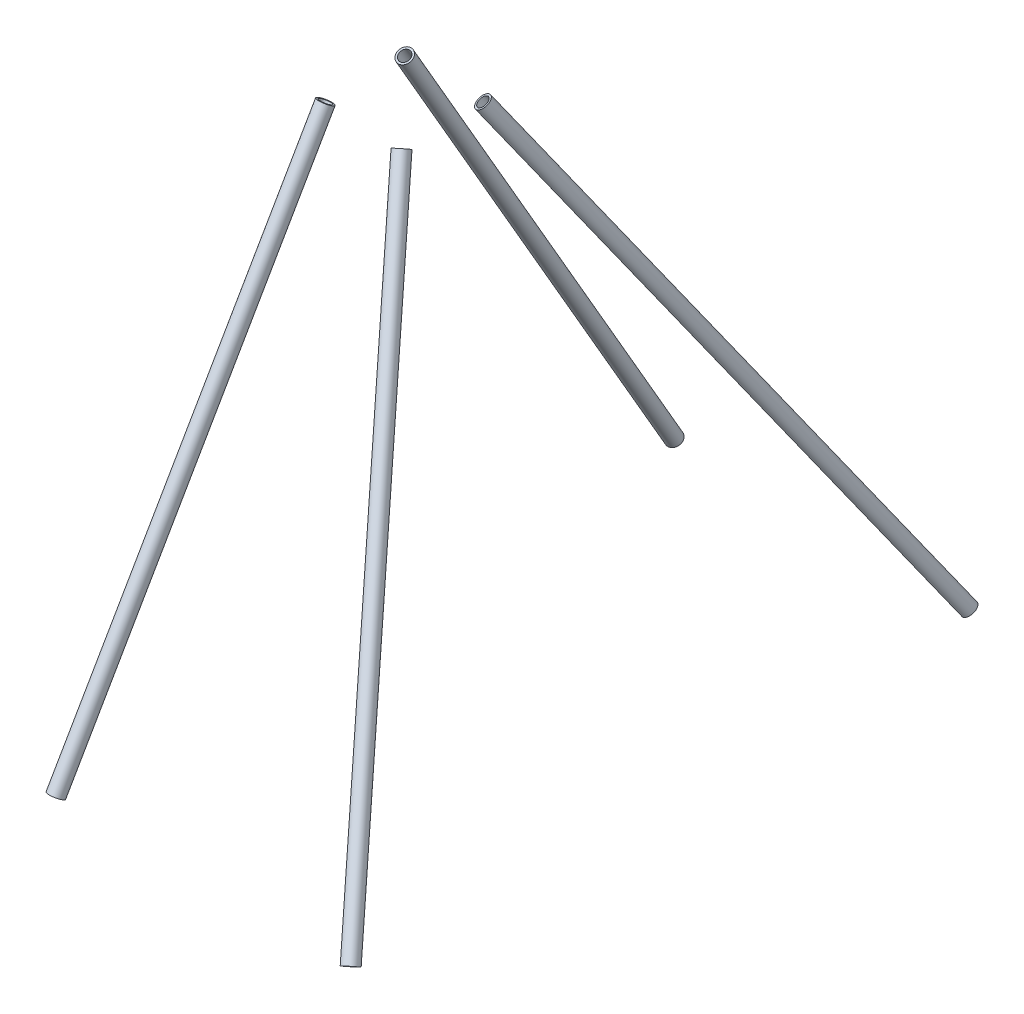
ISO-10303-21;
HEADER;
FILE_DESCRIPTION(('STEP AP214'),'2;1');
FILE_NAME('part.step','',(''),(''),'','','');
FILE_SCHEMA(('AUTOMOTIVE_DESIGN { 1 0 10303 214 1 1 1 1 }'));
ENDSEC;
DATA;
#1=APPLICATION_CONTEXT('core data for automotive mechanical design processes');
#2=APPLICATION_PROTOCOL_DEFINITION('international standard','automotive_design',2000,#1);
#3=PRODUCT_CONTEXT('',#1,'mechanical');
#4=PRODUCT('Part','Part','',(#3));
#5=PRODUCT_RELATED_PRODUCT_CATEGORY('part','',(#4));
#6=PRODUCT_DEFINITION_FORMATION('','',#4);
#7=PRODUCT_DEFINITION_CONTEXT('part definition',#1,'design');
#8=PRODUCT_DEFINITION('design','',#6,#7);
#9=PRODUCT_DEFINITION_SHAPE('','',#8);
#10=(LENGTH_UNIT() NAMED_UNIT(*) SI_UNIT(.MILLI.,.METRE.));
#11=(NAMED_UNIT(*) PLANE_ANGLE_UNIT() SI_UNIT($,.RADIAN.));
#12=(NAMED_UNIT(*) SI_UNIT($,.STERADIAN.) SOLID_ANGLE_UNIT());
#13=UNCERTAINTY_MEASURE_WITH_UNIT(LENGTH_MEASURE(1.E-05),#10,'distance_accuracy_value','');
#14=(GEOMETRIC_REPRESENTATION_CONTEXT(3) GLOBAL_UNCERTAINTY_ASSIGNED_CONTEXT((#13)) GLOBAL_UNIT_ASSIGNED_CONTEXT((#10,
#11,#12)) REPRESENTATION_CONTEXT('',''));
#15=CARTESIAN_POINT('',(0.,0.,0.));
#16=DIRECTION('',(0.,0.,1.));
#17=DIRECTION('',(1.,0.,0.));
#18=AXIS2_PLACEMENT_3D('',#15,#16,#17);
#19=CARTESIAN_POINT('',(65.9616903552644,-5.25160609123071,-34.7860847714928));
#20=DIRECTION('',(-0.376029615587523,0.802196513253382,0.463769859224612));
#21=DIRECTION('',(0.,0.500502949237855,-0.865734831114128));
#22=AXIS2_PLACEMENT_3D('',#19,#20,#21);
#23=PLANE('',#22);
#24=CARTESIAN_POINT('',(65.9616903552644,-5.25160609123071,-34.7860847714928));
#25=DIRECTION('',(0.376029615587523,-0.802196513253382,-0.463769859224612));
#26=DIRECTION('',(0.,0.500502949237855,-0.865734831114128));
#27=AXIS2_PLACEMENT_3D('',#24,#25,#26);
#28=CIRCLE('',#27,6.35000000000002);
#29=CARTESIAN_POINT('',(65.9616903552644,-2.07341236357032,-40.2835009490675));
#30=VERTEX_POINT('',#29);
#31=EDGE_CURVE('E11',#30,#30,#28,.T.);
#32=ORIENTED_EDGE('',*,*,#31,.F.);
#33=EDGE_LOOP('',(#32));
#34=FACE_BOUND('',#33,.T.);
#35=CARTESIAN_POINT('',(65.9616903552644,-5.25160609123071,-34.7860847714928));
#36=DIRECTION('',(0.376029615587523,-0.802196513253382,-0.463769859224612));
#37=DIRECTION('',(0.,0.500502949237855,-0.865734831114128));
#38=AXIS2_PLACEMENT_3D('',#35,#36,#37);
#39=CIRCLE('',#38,4.69900000000002);
#40=CARTESIAN_POINT('',(65.9616903552644,-2.89974273276202,-38.8541727428981));
#41=VERTEX_POINT('',#40);
#42=EDGE_CURVE('E55',#41,#41,#39,.T.);
#43=ORIENTED_EDGE('',*,*,#42,.T.);
#44=EDGE_LOOP('',(#43));
#45=FACE_BOUND('',#44,.T.);
#46=ADVANCED_FACE('F44',(#34,#45),#23,.T.);
#47=CARTESIAN_POINT('',(252.209158955764,-402.579539105631,-264.491296045443));
#48=DIRECTION('',(-0.376029615587523,0.802196513253382,0.463769859224612));
#49=DIRECTION('',(0.,0.500502949237855,-0.865734831114128));
#50=AXIS2_PLACEMENT_3D('',#47,#48,#49);
#51=PLANE('',#50);
#52=CARTESIAN_POINT('',(252.209158955764,-402.579539105631,-264.491296045443));
#53=DIRECTION('',(0.376029615587523,-0.802196513253382,-0.463769859224612));
#54=DIRECTION('',(0.,0.500502949237855,-0.865734831114128));
#55=AXIS2_PLACEMENT_3D('',#52,#53,#54);
#56=CIRCLE('',#55,6.35000000000002);
#57=CARTESIAN_POINT('',(252.209158955764,-399.401345377971,-269.988712223018));
#58=VERTEX_POINT('',#57);
#59=EDGE_CURVE('E48',#58,#58,#56,.T.);
#60=ORIENTED_EDGE('',*,*,#59,.T.);
#61=EDGE_LOOP('',(#60));
#62=FACE_BOUND('',#61,.T.);
#63=CARTESIAN_POINT('',(252.209158955764,-402.579539105631,-264.491296045443));
#64=DIRECTION('',(0.376029615587523,-0.802196513253382,-0.463769859224612));
#65=DIRECTION('',(0.,0.500502949237855,-0.865734831114128));
#66=AXIS2_PLACEMENT_3D('',#63,#64,#65);
#67=CIRCLE('',#66,4.69900000000002);
#68=CARTESIAN_POINT('',(252.209158955764,-400.227675747162,-268.559384016848));
#69=VERTEX_POINT('',#68);
#70=EDGE_CURVE('E57',#69,#69,#67,.T.);
#71=ORIENTED_EDGE('',*,*,#70,.F.);
#72=EDGE_LOOP('',(#71));
#73=FACE_BOUND('',#72,.T.);
#74=ADVANCED_FACE('F70',(#62,#73),#51,.F.);
#75=CARTESIAN_POINT('',(65.9616903552644,-5.25160609123071,-34.7860847714928));
#76=DIRECTION('',(0.376029615587523,-0.802196513253382,-0.463769859224612));
#77=DIRECTION('',(0.,-0.500502949237855,0.865734831114128));
#78=AXIS2_PLACEMENT_3D('',#75,#76,#77);
#79=CYLINDRICAL_SURFACE('',#78,6.35000000000002);
#80=ORIENTED_EDGE('',*,*,#31,.T.);
#81=EDGE_LOOP('',(#80));
#82=FACE_BOUND('',#81,.T.);
#83=ORIENTED_EDGE('',*,*,#59,.F.);
#84=EDGE_LOOP('',(#83));
#85=FACE_BOUND('',#84,.T.);
#86=ADVANCED_FACE('F46',(#82,#85),#79,.T.);
#87=CARTESIAN_POINT('',(65.9616903552644,-5.25160609123071,-34.7860847714928));
#88=DIRECTION('',(0.376029615587523,-0.802196513253382,-0.463769859224612));
#89=DIRECTION('',(0.,-0.500502949237855,0.865734831114128));
#90=AXIS2_PLACEMENT_3D('',#87,#88,#89);
#91=CYLINDRICAL_SURFACE('',#90,4.69900000000002);
#92=ORIENTED_EDGE('',*,*,#42,.F.);
#93=EDGE_LOOP('',(#92));
#94=FACE_BOUND('',#93,.T.);
#95=ORIENTED_EDGE('',*,*,#70,.T.);
#96=EDGE_LOOP('',(#95));
#97=FACE_BOUND('',#96,.T.);
#98=ADVANCED_FACE('F64',(#94,#97),#91,.F.);
#99=CLOSED_SHELL('',(#46,#74,#86,#98));
#100=MANIFOLD_SOLID_BREP('B2',#99);
#101=CARTESIAN_POINT('',(0.,-3.71426499265221,-33.8973094488771));
#102=DIRECTION('',(0.,-0.865734831114129,-0.500502949237855));
#103=DIRECTION('',(0.,-0.500502949237855,0.865734831114129));
#104=AXIS2_PLACEMENT_3D('',#101,#102,#103);
#105=CYLINDRICAL_SURFACE('',#104,4.699);
#106=CARTESIAN_POINT('',(0.,-3.71426499265221,-33.8973094488771));
#107=DIRECTION('',(0.,0.865734831114128,0.500502949237857));
#108=DIRECTION('',(0.,-0.500502949237857,0.865734831114128));
#109=AXIS2_PLACEMENT_3D('',#106,#107,#108);
#110=CIRCLE('',#109,4.699);
#111=CARTESIAN_POINT('',(0.,-6.06612835112089,-29.8292214774718));
#112=VERTEX_POINT('',#111);
#113=EDGE_CURVE('E139',#112,#112,#110,.T.);
#114=ORIENTED_EDGE('',*,*,#113,.T.);
#115=EDGE_LOOP('',(#114));
#116=FACE_BOUND('',#115,.T.);
#117=CARTESIAN_POINT('',(0.,-402.276937866819,-264.316354704255));
#118=DIRECTION('',(0.,0.865734831114128,0.500502949237857));
#119=DIRECTION('',(0.,-0.500502949237857,0.865734831114128));
#120=AXIS2_PLACEMENT_3D('',#117,#118,#119);
#121=CIRCLE('',#120,4.699);
#122=CARTESIAN_POINT('',(0.,-404.628801225288,-260.248266732849));
#123=VERTEX_POINT('',#122);
#124=EDGE_CURVE('E145',#123,#123,#121,.T.);
#125=ORIENTED_EDGE('',*,*,#124,.F.);
#126=EDGE_LOOP('',(#125));
#127=FACE_BOUND('',#126,.T.);
#128=ADVANCED_FACE('F132',(#116,#127),#105,.F.);
#129=CARTESIAN_POINT('',(0.,-3.71426499265221,-33.8973094488771));
#130=DIRECTION('',(0.,-0.865734831114129,-0.500502949237855));
#131=DIRECTION('',(0.,-0.500502949237855,0.865734831114129));
#132=AXIS2_PLACEMENT_3D('',#129,#130,#131);
#133=CYLINDRICAL_SURFACE('',#132,6.35);
#134=CARTESIAN_POINT('',(0.,-3.71426499265221,-33.8973094488771));
#135=DIRECTION('',(0.,0.865734831114128,0.500502949237857));
#136=DIRECTION('',(0.,-0.500502949237857,0.865734831114128));
#137=AXIS2_PLACEMENT_3D('',#134,#135,#136);
#138=CIRCLE('',#137,6.35);
#139=CARTESIAN_POINT('',(0.,-6.8924587203126,-28.3998932713024));
#140=VERTEX_POINT('',#139);
#141=EDGE_CURVE('E43',#140,#140,#138,.T.);
#142=ORIENTED_EDGE('',*,*,#141,.F.);
#143=EDGE_LOOP('',(#142));
#144=FACE_BOUND('',#143,.T.);
#145=CARTESIAN_POINT('',(0.,-402.276937866819,-264.316354704255));
#146=DIRECTION('',(0.,0.865734831114128,0.500502949237857));
#147=DIRECTION('',(0.,-0.500502949237857,0.865734831114128));
#148=AXIS2_PLACEMENT_3D('',#145,#146,#147);
#149=CIRCLE('',#148,6.35);
#150=CARTESIAN_POINT('',(0.,-405.45513159448,-258.81893852668));
#151=VERTEX_POINT('',#150);
#152=EDGE_CURVE('E135',#151,#151,#149,.T.);
#153=ORIENTED_EDGE('',*,*,#152,.T.);
#154=EDGE_LOOP('',(#153));
#155=FACE_BOUND('',#154,.T.);
#156=ADVANCED_FACE('F152',(#144,#155),#133,.T.);
#157=CARTESIAN_POINT('',(0.,-17.471630042972,-10.1007861185942));
#158=DIRECTION('',(0.,-0.865734831114128,-0.500502949237857));
#159=DIRECTION('',(0.,-0.500502949237857,0.865734831114128));
#160=AXIS2_PLACEMENT_3D('',#157,#158,#159);
#161=PLANE('',#160);
#162=ORIENTED_EDGE('',*,*,#113,.F.);
#163=EDGE_LOOP('',(#162));
#164=FACE_BOUND('',#163,.T.);
#165=ORIENTED_EDGE('',*,*,#141,.T.);
#166=EDGE_LOOP('',(#165));
#167=FACE_BOUND('',#166,.T.);
#168=ADVANCED_FACE('F156',(#164,#167),#161,.F.);
#169=CARTESIAN_POINT('',(0.,-416.034302917139,-240.519831373972));
#170=DIRECTION('',(0.,-0.865734831114128,-0.500502949237857));
#171=DIRECTION('',(0.,-0.500502949237857,0.865734831114128));
#172=AXIS2_PLACEMENT_3D('',#169,#170,#171);
#173=PLANE('',#172);
#174=ORIENTED_EDGE('',*,*,#124,.T.);
#175=EDGE_LOOP('',(#174));
#176=FACE_BOUND('',#175,.T.);
#177=ORIENTED_EDGE('',*,*,#152,.F.);
#178=EDGE_LOOP('',(#177));
#179=FACE_BOUND('',#178,.T.);
#180=ADVANCED_FACE('F154',(#176,#179),#173,.T.);
#181=CLOSED_SHELL('',(#128,#156,#168,#180));
#182=MANIFOLD_SOLID_BREP('B6',#181);
#183=CARTESIAN_POINT('',(65.9616903552644,-5.25160609123071,34.7860847714928));
#184=DIRECTION('',(-0.376029615587523,0.802196513253382,-0.463769859224612));
#185=DIRECTION('',(0.,0.500502949237855,0.865734831114128));
#186=AXIS2_PLACEMENT_3D('',#183,#184,#185);
#187=PLANE('',#186);
#188=CARTESIAN_POINT('',(65.9616903552644,-5.25160609123071,34.7860847714928));
#189=DIRECTION('',(-0.376029615587523,0.802196513253382,-0.463769859224612));
#190=DIRECTION('',(0.,0.500502949237855,0.865734831114128));
#191=AXIS2_PLACEMENT_3D('',#188,#189,#190);
#192=CIRCLE('',#191,6.35000000000002);
#193=CARTESIAN_POINT('',(65.9616903552644,-2.07341236357032,40.2835009490675));
#194=VERTEX_POINT('',#193);
#195=EDGE_CURVE('E131',#194,#194,#192,.T.);
#196=ORIENTED_EDGE('',*,*,#195,.T.);
#197=EDGE_LOOP('',(#196));
#198=FACE_BOUND('',#197,.T.);
#199=CARTESIAN_POINT('',(65.9616903552644,-5.25160609123071,34.7860847714928));
#200=DIRECTION('',(-0.376029615587523,0.802196513253382,-0.463769859224612));
#201=DIRECTION('',(0.,0.500502949237855,0.865734831114128));
#202=AXIS2_PLACEMENT_3D('',#199,#200,#201);
#203=CIRCLE('',#202,4.69900000000002);
#204=CARTESIAN_POINT('',(65.9616903552644,-2.89974273276202,38.8541727428981));
#205=VERTEX_POINT('',#204);
#206=EDGE_CURVE('E232',#205,#205,#203,.T.);
#207=ORIENTED_EDGE('',*,*,#206,.F.);
#208=EDGE_LOOP('',(#207));
#209=FACE_BOUND('',#208,.T.);
#210=ADVANCED_FACE('F221',(#198,#209),#187,.T.);
#211=CARTESIAN_POINT('',(252.209158955764,-402.579539105631,264.491296045443));
#212=DIRECTION('',(-0.376029615587523,0.802196513253382,-0.463769859224612));
#213=DIRECTION('',(0.,0.500502949237855,0.865734831114128));
#214=AXIS2_PLACEMENT_3D('',#211,#212,#213);
#215=PLANE('',#214);
#216=CARTESIAN_POINT('',(252.209158955764,-402.579539105631,264.491296045443));
#217=DIRECTION('',(-0.376029615587523,0.802196513253382,-0.463769859224612));
#218=DIRECTION('',(0.,0.500502949237855,0.865734831114128));
#219=AXIS2_PLACEMENT_3D('',#216,#217,#218);
#220=CIRCLE('',#219,6.35000000000002);
#221=CARTESIAN_POINT('',(252.209158955764,-399.401345377971,269.988712223018));
#222=VERTEX_POINT('',#221);
#223=EDGE_CURVE('E225',#222,#222,#220,.T.);
#224=ORIENTED_EDGE('',*,*,#223,.F.);
#225=EDGE_LOOP('',(#224));
#226=FACE_BOUND('',#225,.T.);
#227=CARTESIAN_POINT('',(252.209158955764,-402.579539105631,264.491296045443));
#228=DIRECTION('',(-0.376029615587523,0.802196513253382,-0.463769859224612));
#229=DIRECTION('',(0.,0.500502949237855,0.865734831114128));
#230=AXIS2_PLACEMENT_3D('',#227,#228,#229);
#231=CIRCLE('',#230,4.69900000000002);
#232=CARTESIAN_POINT('',(252.209158955764,-400.227675747162,268.559384016848));
#233=VERTEX_POINT('',#232);
#234=EDGE_CURVE('E234',#233,#233,#231,.T.);
#235=ORIENTED_EDGE('',*,*,#234,.T.);
#236=EDGE_LOOP('',(#235));
#237=FACE_BOUND('',#236,.T.);
#238=ADVANCED_FACE('F244',(#226,#237),#215,.F.);
#239=CARTESIAN_POINT('',(65.9616903552644,-5.25160609123071,34.7860847714928));
#240=DIRECTION('',(0.376029615587523,-0.802196513253382,0.463769859224612));
#241=DIRECTION('',(0.,-0.500502949237855,-0.865734831114128));
#242=AXIS2_PLACEMENT_3D('',#239,#240,#241);
#243=CYLINDRICAL_SURFACE('',#242,6.35000000000002);
#244=ORIENTED_EDGE('',*,*,#195,.F.);
#245=EDGE_LOOP('',(#244));
#246=FACE_BOUND('',#245,.T.);
#247=ORIENTED_EDGE('',*,*,#223,.T.);
#248=EDGE_LOOP('',(#247));
#249=FACE_BOUND('',#248,.T.);
#250=ADVANCED_FACE('F223',(#246,#249),#243,.T.);
#251=CARTESIAN_POINT('',(65.9616903552644,-5.25160609123071,34.7860847714928));
#252=DIRECTION('',(0.376029615587523,-0.802196513253382,0.463769859224612));
#253=DIRECTION('',(0.,-0.500502949237855,-0.865734831114128));
#254=AXIS2_PLACEMENT_3D('',#251,#252,#253);
#255=CYLINDRICAL_SURFACE('',#254,4.69900000000002);
#256=ORIENTED_EDGE('',*,*,#206,.T.);
#257=EDGE_LOOP('',(#256));
#258=FACE_BOUND('',#257,.T.);
#259=ORIENTED_EDGE('',*,*,#234,.F.);
#260=EDGE_LOOP('',(#259));
#261=FACE_BOUND('',#260,.T.);
#262=ADVANCED_FACE('F240',(#258,#261),#255,.F.);
#263=CLOSED_SHELL('',(#210,#238,#250,#262));
#264=MANIFOLD_SOLID_BREP('B38',#263);
#265=CARTESIAN_POINT('',(0.,-3.71426499265221,33.8973094488771));
#266=DIRECTION('',(0.,-0.865734831114129,0.500502949237855));
#267=DIRECTION('',(0.,-0.500502949237855,-0.865734831114129));
#268=AXIS2_PLACEMENT_3D('',#265,#266,#267);
#269=CYLINDRICAL_SURFACE('',#268,4.699);
#270=CARTESIAN_POINT('',(0.,-3.71426499265221,33.8973094488771));
#271=DIRECTION('',(0.,-0.865734831114128,0.500502949237857));
#272=DIRECTION('',(0.,-0.500502949237857,-0.865734831114128));
#273=AXIS2_PLACEMENT_3D('',#270,#271,#272);
#274=CIRCLE('',#273,4.699);
#275=CARTESIAN_POINT('',(0.,-6.06612835112089,29.8292214774718));
#276=VERTEX_POINT('',#275);
#277=EDGE_CURVE('E290',#276,#276,#274,.T.);
#278=ORIENTED_EDGE('',*,*,#277,.F.);
#279=EDGE_LOOP('',(#278));
#280=FACE_BOUND('',#279,.T.);
#281=CARTESIAN_POINT('',(0.,-402.276937866819,264.316354704255));
#282=DIRECTION('',(0.,-0.865734831114128,0.500502949237857));
#283=DIRECTION('',(0.,-0.500502949237857,-0.865734831114128));
#284=AXIS2_PLACEMENT_3D('',#281,#282,#283);
#285=CIRCLE('',#284,4.699);
#286=CARTESIAN_POINT('',(0.,-404.628801225288,260.248266732849));
#287=VERTEX_POINT('',#286);
#288=EDGE_CURVE('E296',#287,#287,#285,.T.);
#289=ORIENTED_EDGE('',*,*,#288,.T.);
#290=EDGE_LOOP('',(#289));
#291=FACE_BOUND('',#290,.T.);
#292=ADVANCED_FACE('F283',(#280,#291),#269,.F.);
#293=CARTESIAN_POINT('',(0.,-3.71426499265221,33.8973094488771));
#294=DIRECTION('',(0.,-0.865734831114129,0.500502949237855));
#295=DIRECTION('',(0.,-0.500502949237855,-0.865734831114129));
#296=AXIS2_PLACEMENT_3D('',#293,#294,#295);
#297=CYLINDRICAL_SURFACE('',#296,6.35);
#298=CARTESIAN_POINT('',(0.,-3.71426499265221,33.8973094488771));
#299=DIRECTION('',(0.,-0.865734831114128,0.500502949237857));
#300=DIRECTION('',(0.,-0.500502949237857,-0.865734831114128));
#301=AXIS2_PLACEMENT_3D('',#298,#299,#300);
#302=CIRCLE('',#301,6.35);
#303=CARTESIAN_POINT('',(0.,-6.8924587203126,28.3998932713024));
#304=VERTEX_POINT('',#303);
#305=EDGE_CURVE('E220',#304,#304,#302,.T.);
#306=ORIENTED_EDGE('',*,*,#305,.T.);
#307=EDGE_LOOP('',(#306));
#308=FACE_BOUND('',#307,.T.);
#309=CARTESIAN_POINT('',(0.,-402.276937866819,264.316354704255));
#310=DIRECTION('',(0.,-0.865734831114128,0.500502949237857));
#311=DIRECTION('',(0.,-0.500502949237857,-0.865734831114128));
#312=AXIS2_PLACEMENT_3D('',#309,#310,#311);
#313=CIRCLE('',#312,6.35);
#314=CARTESIAN_POINT('',(0.,-405.45513159448,258.81893852668));
#315=VERTEX_POINT('',#314);
#316=EDGE_CURVE('E286',#315,#315,#313,.T.);
#317=ORIENTED_EDGE('',*,*,#316,.F.);
#318=EDGE_LOOP('',(#317));
#319=FACE_BOUND('',#318,.T.);
#320=ADVANCED_FACE('F305',(#308,#319),#297,.T.);
#321=CARTESIAN_POINT('',(0.,-17.471630042972,10.1007861185942));
#322=DIRECTION('',(0.,-0.865734831114128,0.500502949237857));
#323=DIRECTION('',(0.,-0.500502949237857,-0.865734831114128));
#324=AXIS2_PLACEMENT_3D('',#321,#322,#323);
#325=PLANE('',#324);
#326=ORIENTED_EDGE('',*,*,#277,.T.);
#327=EDGE_LOOP('',(#326));
#328=FACE_BOUND('',#327,.T.);
#329=ORIENTED_EDGE('',*,*,#305,.F.);
#330=EDGE_LOOP('',(#329));
#331=FACE_BOUND('',#330,.T.);
#332=ADVANCED_FACE('F307',(#328,#331),#325,.F.);
#333=CARTESIAN_POINT('',(0.,-416.034302917139,240.519831373972));
#334=DIRECTION('',(0.,-0.865734831114128,0.500502949237857));
#335=DIRECTION('',(0.,-0.500502949237857,-0.865734831114128));
#336=AXIS2_PLACEMENT_3D('',#333,#334,#335);
#337=PLANE('',#336);
#338=ORIENTED_EDGE('',*,*,#288,.F.);
#339=EDGE_LOOP('',(#338));
#340=FACE_BOUND('',#339,.T.);
#341=ORIENTED_EDGE('',*,*,#316,.T.);
#342=EDGE_LOOP('',(#341));
#343=FACE_BOUND('',#342,.T.);
#344=ADVANCED_FACE('F303',(#340,#343),#337,.T.);
#345=CLOSED_SHELL('',(#292,#320,#332,#344));
#346=MANIFOLD_SOLID_BREP('B126',#345);
#347=ADVANCED_BREP_SHAPE_REPRESENTATION('',(#18,#100,#182,#264,#346),#14);
#348=SHAPE_DEFINITION_REPRESENTATION(#9,#347);
ENDSEC;
END-ISO-10303-21;
